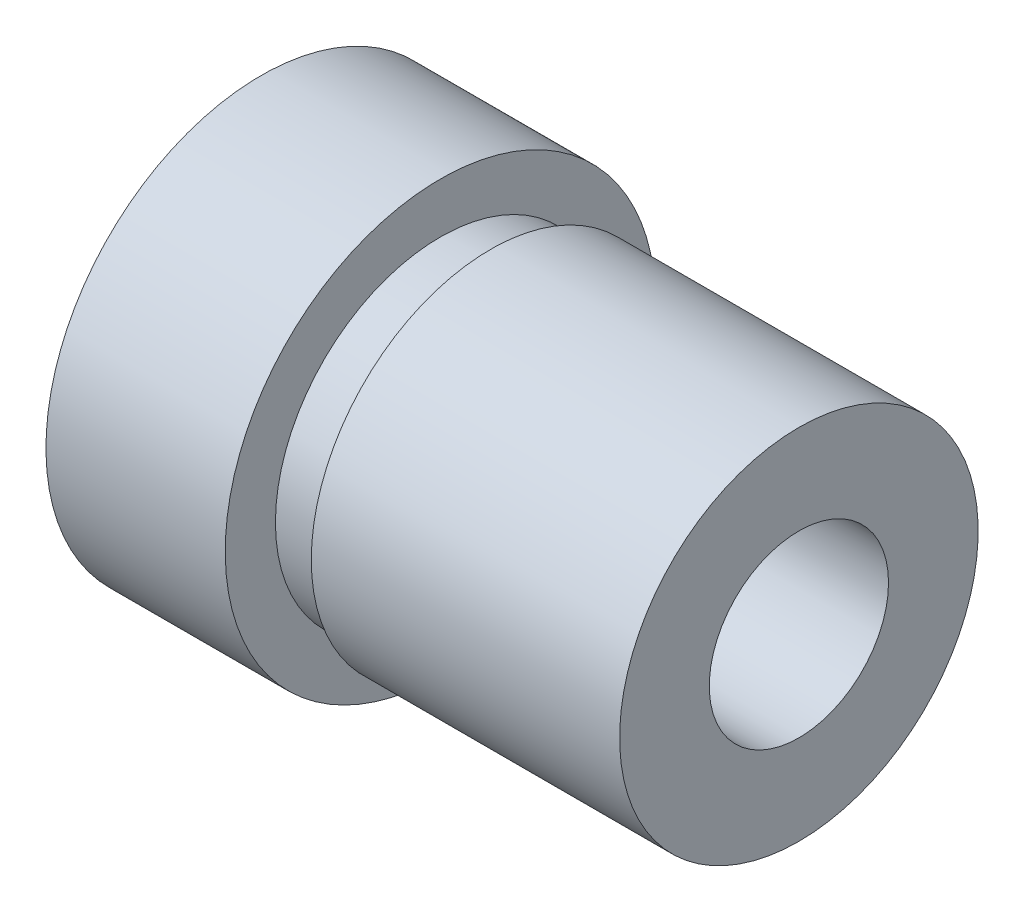
ISO-10303-21;
HEADER;
FILE_DESCRIPTION(('STEP AP214'),'2;1');
FILE_NAME('part.step','',(''),(''),'','','');
FILE_SCHEMA(('AUTOMOTIVE_DESIGN { 1 0 10303 214 1 1 1 1 }'));
ENDSEC;
DATA;
#1=APPLICATION_CONTEXT('core data for automotive mechanical design processes');
#2=APPLICATION_PROTOCOL_DEFINITION('international standard','automotive_design',2000,#1);
#3=PRODUCT_CONTEXT('',#1,'mechanical');
#4=PRODUCT('Part','Part','',(#3));
#5=PRODUCT_RELATED_PRODUCT_CATEGORY('part','',(#4));
#6=PRODUCT_DEFINITION_FORMATION('','',#4);
#7=PRODUCT_DEFINITION_CONTEXT('part definition',#1,'design');
#8=PRODUCT_DEFINITION('design','',#6,#7);
#9=PRODUCT_DEFINITION_SHAPE('','',#8);
#10=(LENGTH_UNIT() NAMED_UNIT(*) SI_UNIT(.MILLI.,.METRE.));
#11=(NAMED_UNIT(*) PLANE_ANGLE_UNIT() SI_UNIT($,.RADIAN.));
#12=(NAMED_UNIT(*) SI_UNIT($,.STERADIAN.) SOLID_ANGLE_UNIT());
#13=UNCERTAINTY_MEASURE_WITH_UNIT(LENGTH_MEASURE(1.E-05),#10,'distance_accuracy_value','');
#14=(GEOMETRIC_REPRESENTATION_CONTEXT(3) GLOBAL_UNCERTAINTY_ASSIGNED_CONTEXT((#13)) GLOBAL_UNIT_ASSIGNED_CONTEXT((#10,
#11,#12)) REPRESENTATION_CONTEXT('',''));
#15=CARTESIAN_POINT('',(0.,0.,0.));
#16=DIRECTION('',(0.,0.,1.));
#17=DIRECTION('',(1.,0.,0.));
#18=AXIS2_PLACEMENT_3D('',#15,#16,#17);
#19=CARTESIAN_POINT('',(0.,0.,0.));
#20=DIRECTION('',(-1.,0.,0.));
#21=DIRECTION('',(0.,-1.,0.));
#22=AXIS2_PLACEMENT_3D('',#19,#20,#21);
#23=CYLINDRICAL_SURFACE('',#22,2.5);
#24=CARTESIAN_POINT('',(3.75,0.,0.));
#25=DIRECTION('',(-1.,0.,0.));
#26=DIRECTION('',(0.,-1.,0.));
#27=AXIS2_PLACEMENT_3D('',#24,#25,#26);
#28=CIRCLE('',#27,2.5);
#29=CARTESIAN_POINT('',(3.75,-2.5,0.));
#30=VERTEX_POINT('',#29);
#31=EDGE_CURVE('E44',#30,#30,#28,.T.);
#32=ORIENTED_EDGE('',*,*,#31,.T.);
#33=EDGE_LOOP('',(#32));
#34=FACE_BOUND('',#33,.T.);
#35=CARTESIAN_POINT('',(-0.549999999999999,0.,0.));
#36=DIRECTION('',(-1.,0.,0.));
#37=DIRECTION('',(0.,0.,1.));
#38=AXIS2_PLACEMENT_3D('',#35,#36,#37);
#39=CIRCLE('',#38,2.5);
#40=CARTESIAN_POINT('',(-0.549999999999999,0.,2.5));
#41=VERTEX_POINT('',#40);
#42=EDGE_CURVE('E36',#41,#41,#39,.T.);
#43=ORIENTED_EDGE('',*,*,#42,.F.);
#44=EDGE_LOOP('',(#43));
#45=FACE_BOUND('',#44,.T.);
#46=ADVANCED_FACE('F32',(#34,#45),#23,.T.);
#47=CARTESIAN_POINT('',(-3.75,0.,0.));
#48=DIRECTION('',(1.,0.,0.));
#49=DIRECTION('',(0.,1.,0.));
#50=AXIS2_PLACEMENT_3D('',#47,#48,#49);
#51=PLANE('',#50);
#52=CARTESIAN_POINT('',(-3.75,0.,0.));
#53=DIRECTION('',(1.,0.,0.));
#54=DIRECTION('',(0.,0.,-1.));
#55=AXIS2_PLACEMENT_3D('',#52,#53,#54);
#56=CIRCLE('',#55,1.25);
#57=CARTESIAN_POINT('',(-3.75,0.,-1.25));
#58=VERTEX_POINT('',#57);
#59=EDGE_CURVE('E49',#58,#58,#56,.T.);
#60=ORIENTED_EDGE('',*,*,#59,.T.);
#61=EDGE_LOOP('',(#60));
#62=FACE_BOUND('',#61,.T.);
#63=CARTESIAN_POINT('',(-3.75,0.,0.));
#64=DIRECTION('',(-1.,0.,0.));
#65=DIRECTION('',(0.,-1.,0.));
#66=AXIS2_PLACEMENT_3D('',#63,#64,#65);
#67=CIRCLE('',#66,3.);
#68=CARTESIAN_POINT('',(-3.75,-3.,0.));
#69=VERTEX_POINT('',#68);
#70=EDGE_CURVE('E10',#69,#69,#67,.T.);
#71=ORIENTED_EDGE('',*,*,#70,.T.);
#72=EDGE_LOOP('',(#71));
#73=FACE_BOUND('',#72,.T.);
#74=ADVANCED_FACE('F34',(#62,#73),#51,.F.);
#75=CARTESIAN_POINT('',(0.,0.,0.));
#76=DIRECTION('',(-1.,0.,0.));
#77=DIRECTION('',(0.,-1.,0.));
#78=AXIS2_PLACEMENT_3D('',#75,#76,#77);
#79=CYLINDRICAL_SURFACE('',#78,3.);
#80=ORIENTED_EDGE('',*,*,#70,.F.);
#81=EDGE_LOOP('',(#80));
#82=FACE_BOUND('',#81,.T.);
#83=CARTESIAN_POINT('',(-1.25,0.,0.));
#84=DIRECTION('',(-1.,0.,0.));
#85=DIRECTION('',(0.,-1.,0.));
#86=AXIS2_PLACEMENT_3D('',#83,#84,#85);
#87=CIRCLE('',#86,3.);
#88=CARTESIAN_POINT('',(-1.25,-3.,0.));
#89=VERTEX_POINT('',#88);
#90=EDGE_CURVE('E40',#89,#89,#87,.T.);
#91=ORIENTED_EDGE('',*,*,#90,.T.);
#92=EDGE_LOOP('',(#91));
#93=FACE_BOUND('',#92,.T.);
#94=ADVANCED_FACE('F79',(#82,#93),#79,.T.);
#95=CARTESIAN_POINT('',(-1.25,3.,0.));
#96=DIRECTION('',(-1.,0.,0.));
#97=DIRECTION('',(0.,-1.,0.));
#98=AXIS2_PLACEMENT_3D('',#95,#96,#97);
#99=PLANE('',#98);
#100=ORIENTED_EDGE('',*,*,#90,.F.);
#101=EDGE_LOOP('',(#100));
#102=FACE_BOUND('',#101,.T.);
#103=CARTESIAN_POINT('',(-1.25,0.,0.));
#104=DIRECTION('',(-1.,0.,0.));
#105=DIRECTION('',(0.,0.,1.));
#106=AXIS2_PLACEMENT_3D('',#103,#104,#105);
#107=CIRCLE('',#106,2.3);
#108=CARTESIAN_POINT('',(-1.25,0.,2.3));
#109=VERTEX_POINT('',#108);
#110=EDGE_CURVE('E55',#109,#109,#107,.T.);
#111=ORIENTED_EDGE('',*,*,#110,.T.);
#112=EDGE_LOOP('',(#111));
#113=FACE_BOUND('',#112,.T.);
#114=ADVANCED_FACE('F85',(#102,#113),#99,.F.);
#115=CARTESIAN_POINT('',(3.75,2.5,0.));
#116=DIRECTION('',(-1.,0.,0.));
#117=DIRECTION('',(0.,-1.,0.));
#118=AXIS2_PLACEMENT_3D('',#115,#116,#117);
#119=PLANE('',#118);
#120=CARTESIAN_POINT('',(3.75,0.,0.));
#121=DIRECTION('',(1.,0.,0.));
#122=DIRECTION('',(0.,0.,-1.));
#123=AXIS2_PLACEMENT_3D('',#120,#121,#122);
#124=CIRCLE('',#123,1.24999999999999);
#125=CARTESIAN_POINT('',(3.75,0.,-1.24999999999999));
#126=VERTEX_POINT('',#125);
#127=EDGE_CURVE('E52',#126,#126,#124,.T.);
#128=ORIENTED_EDGE('',*,*,#127,.F.);
#129=EDGE_LOOP('',(#128));
#130=FACE_BOUND('',#129,.T.);
#131=ORIENTED_EDGE('',*,*,#31,.F.);
#132=EDGE_LOOP('',(#131));
#133=FACE_BOUND('',#132,.T.);
#134=ADVANCED_FACE('F83',(#130,#133),#119,.F.);
#135=CARTESIAN_POINT('',(3.75,0.,0.));
#136=DIRECTION('',(1.,0.,0.));
#137=DIRECTION('',(0.,0.,-1.));
#138=AXIS2_PLACEMENT_3D('',#135,#136,#137);
#139=CYLINDRICAL_SURFACE('',#138,1.24999999999999);
#140=ORIENTED_EDGE('',*,*,#59,.F.);
#141=EDGE_LOOP('',(#140));
#142=FACE_BOUND('',#141,.T.);
#143=ORIENTED_EDGE('',*,*,#127,.T.);
#144=EDGE_LOOP('',(#143));
#145=FACE_BOUND('',#144,.T.);
#146=ADVANCED_FACE('F68',(#142,#145),#139,.F.);
#147=CARTESIAN_POINT('',(-0.549999999999999,3.,0.));
#148=DIRECTION('',(-1.,0.,0.));
#149=DIRECTION('',(0.,0.,1.));
#150=AXIS2_PLACEMENT_3D('',#147,#148,#149);
#151=PLANE('',#150);
#152=CARTESIAN_POINT('',(-0.549999999999999,0.,0.));
#153=DIRECTION('',(-1.,0.,0.));
#154=DIRECTION('',(0.,0.,1.));
#155=AXIS2_PLACEMENT_3D('',#152,#153,#154);
#156=CIRCLE('',#155,2.3);
#157=CARTESIAN_POINT('',(-0.549999999999999,0.,2.3));
#158=VERTEX_POINT('',#157);
#159=EDGE_CURVE('E58',#158,#158,#156,.T.);
#160=ORIENTED_EDGE('',*,*,#159,.F.);
#161=EDGE_LOOP('',(#160));
#162=FACE_BOUND('',#161,.T.);
#163=ORIENTED_EDGE('',*,*,#42,.T.);
#164=EDGE_LOOP('',(#163));
#165=FACE_BOUND('',#164,.T.);
#166=ADVANCED_FACE('F65',(#162,#165),#151,.T.);
#167=CARTESIAN_POINT('',(-0.0903469831849656,0.,0.));
#168=DIRECTION('',(-1.,0.,0.));
#169=DIRECTION('',(0.,0.,1.));
#170=AXIS2_PLACEMENT_3D('',#167,#168,#169);
#171=CYLINDRICAL_SURFACE('',#170,2.3);
#172=ORIENTED_EDGE('',*,*,#159,.T.);
#173=EDGE_LOOP('',(#172));
#174=FACE_BOUND('',#173,.T.);
#175=ORIENTED_EDGE('',*,*,#110,.F.);
#176=EDGE_LOOP('',(#175));
#177=FACE_BOUND('',#176,.T.);
#178=ADVANCED_FACE('F62',(#174,#177),#171,.T.);
#179=CLOSED_SHELL('',(#46,#74,#94,#114,#134,#146,#166,#178));
#180=MANIFOLD_SOLID_BREP('B2',#179);
#181=ADVANCED_BREP_SHAPE_REPRESENTATION('',(#18,#180),#14);
#182=SHAPE_DEFINITION_REPRESENTATION(#9,#181);
ENDSEC;
END-ISO-10303-21;
